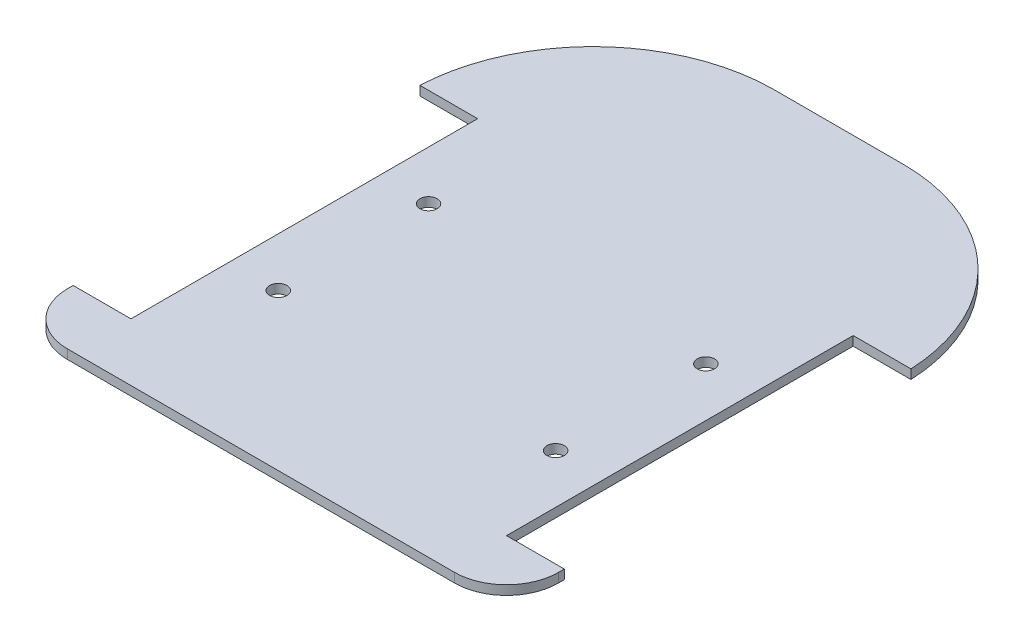
ISO-10303-21;
HEADER;
FILE_DESCRIPTION(('STEP AP214'),'2;1');
FILE_NAME('part.step','',(''),(''),'','','');
FILE_SCHEMA(('AUTOMOTIVE_DESIGN { 1 0 10303 214 1 1 1 1 }'));
ENDSEC;
DATA;
#1=APPLICATION_CONTEXT('core data for automotive mechanical design processes');
#2=APPLICATION_PROTOCOL_DEFINITION('international standard','automotive_design',2000,#1);
#3=PRODUCT_CONTEXT('',#1,'mechanical');
#4=PRODUCT('Part','Part','',(#3));
#5=PRODUCT_RELATED_PRODUCT_CATEGORY('part','',(#4));
#6=PRODUCT_DEFINITION_FORMATION('','',#4);
#7=PRODUCT_DEFINITION_CONTEXT('part definition',#1,'design');
#8=PRODUCT_DEFINITION('design','',#6,#7);
#9=PRODUCT_DEFINITION_SHAPE('','',#8);
#10=(LENGTH_UNIT() NAMED_UNIT(*) SI_UNIT(.MILLI.,.METRE.));
#11=(NAMED_UNIT(*) PLANE_ANGLE_UNIT() SI_UNIT($,.RADIAN.));
#12=(NAMED_UNIT(*) SI_UNIT($,.STERADIAN.) SOLID_ANGLE_UNIT());
#13=UNCERTAINTY_MEASURE_WITH_UNIT(LENGTH_MEASURE(1.E-05),#10,'distance_accuracy_value','');
#14=(GEOMETRIC_REPRESENTATION_CONTEXT(3) GLOBAL_UNCERTAINTY_ASSIGNED_CONTEXT((#13)) GLOBAL_UNIT_ASSIGNED_CONTEXT((#10,
#11,#12)) REPRESENTATION_CONTEXT('',''));
#15=CARTESIAN_POINT('',(0.,0.,0.));
#16=DIRECTION('',(0.,0.,1.));
#17=DIRECTION('',(1.,0.,0.));
#18=AXIS2_PLACEMENT_3D('',#15,#16,#17);
#19=CARTESIAN_POINT('',(26.5,0.,23.));
#20=DIRECTION('',(0.,1.,0.));
#21=DIRECTION('',(0.,0.,1.));
#22=AXIS2_PLACEMENT_3D('',#19,#20,#21);
#23=CYLINDRICAL_SURFACE('',#22,1.5);
#24=CARTESIAN_POINT('',(26.5,0.,23.));
#25=DIRECTION('',(0.,1.,0.));
#26=DIRECTION('',(0.,0.,-1.));
#27=AXIS2_PLACEMENT_3D('',#24,#25,#26);
#28=CIRCLE('',#27,1.5);
#29=CARTESIAN_POINT('',(26.5,0.,21.5));
#30=VERTEX_POINT('',#29);
#31=EDGE_CURVE('E136',#30,#30,#28,.T.);
#32=ORIENTED_EDGE('',*,*,#31,.F.);
#33=EDGE_LOOP('',(#32));
#34=FACE_BOUND('',#33,.T.);
#35=CARTESIAN_POINT('',(26.5,1.6,23.));
#36=DIRECTION('',(0.,1.,0.));
#37=DIRECTION('',(0.,0.,-1.));
#38=AXIS2_PLACEMENT_3D('',#35,#36,#37);
#39=CIRCLE('',#38,1.5);
#40=CARTESIAN_POINT('',(26.5,1.6,21.5));
#41=VERTEX_POINT('',#40);
#42=EDGE_CURVE('E183',#41,#41,#39,.T.);
#43=ORIENTED_EDGE('',*,*,#42,.T.);
#44=EDGE_LOOP('',(#43));
#45=FACE_BOUND('',#44,.T.);
#46=ADVANCED_FACE('F34',(#34,#45),#23,.F.);
#47=CARTESIAN_POINT('',(26.5,0.,-2.99999999999999));
#48=DIRECTION('',(0.,1.,0.));
#49=DIRECTION('',(0.,0.,1.));
#50=AXIS2_PLACEMENT_3D('',#47,#48,#49);
#51=CYLINDRICAL_SURFACE('',#50,1.5);
#52=CARTESIAN_POINT('',(26.5,0.,-2.99999999999999));
#53=DIRECTION('',(0.,1.,0.));
#54=DIRECTION('',(0.,0.,-1.));
#55=AXIS2_PLACEMENT_3D('',#52,#53,#54);
#56=CIRCLE('',#55,1.5);
#57=CARTESIAN_POINT('',(26.5,0.,-4.49999999999999));
#58=VERTEX_POINT('',#57);
#59=EDGE_CURVE('E179',#58,#58,#56,.T.);
#60=ORIENTED_EDGE('',*,*,#59,.F.);
#61=EDGE_LOOP('',(#60));
#62=FACE_BOUND('',#61,.T.);
#63=CARTESIAN_POINT('',(26.5,1.6,-2.99999999999999));
#64=DIRECTION('',(0.,1.,0.));
#65=DIRECTION('',(0.,0.,-1.));
#66=AXIS2_PLACEMENT_3D('',#63,#64,#65);
#67=CIRCLE('',#66,1.5);
#68=CARTESIAN_POINT('',(26.5,1.6,-4.49999999999999));
#69=VERTEX_POINT('',#68);
#70=EDGE_CURVE('E176',#69,#69,#67,.T.);
#71=ORIENTED_EDGE('',*,*,#70,.T.);
#72=EDGE_LOOP('',(#71));
#73=FACE_BOUND('',#72,.T.);
#74=ADVANCED_FACE('F314',(#62,#73),#51,.F.);
#75=CARTESIAN_POINT('',(36.,1.6,41.));
#76=DIRECTION('',(0.,-1.,0.));
#77=DIRECTION('',(0.,0.,-1.));
#78=AXIS2_PLACEMENT_3D('',#75,#76,#77);
#79=CYLINDRICAL_SURFACE('',#78,8.99999999999999);
#80=CARTESIAN_POINT('',(36.,0.,41.));
#81=DIRECTION('',(0.,1.,0.));
#82=DIRECTION('',(0.,0.,1.));
#83=AXIS2_PLACEMENT_3D('',#80,#81,#82);
#84=CIRCLE('',#83,8.99999999999999);
#85=CARTESIAN_POINT('',(36.,0.,50.));
#86=VERTEX_POINT('',#85);
#87=CARTESIAN_POINT('',(45.,0.,41.));
#88=VERTEX_POINT('',#87);
#89=EDGE_CURVE('E135',#86,#88,#84,.T.);
#90=ORIENTED_EDGE('',*,*,#89,.T.);
#91=DIRECTION('',(0.,-1.,0.));
#92=VECTOR('',#91,1.);
#93=CARTESIAN_POINT('',(45.,1.6,41.));
#94=LINE('',#93,#92);
#95=CARTESIAN_POINT('',(45.,1.6,41.));
#96=VERTEX_POINT('',#95);
#97=EDGE_CURVE('E43',#96,#88,#94,.T.);
#98=ORIENTED_EDGE('',*,*,#97,.F.);
#99=CARTESIAN_POINT('',(36.,1.6,41.));
#100=DIRECTION('',(0.,1.,0.));
#101=DIRECTION('',(0.,0.,1.));
#102=AXIS2_PLACEMENT_3D('',#99,#100,#101);
#103=CIRCLE('',#102,8.99999999999999);
#104=CARTESIAN_POINT('',(36.,1.6,50.));
#105=VERTEX_POINT('',#104);
#106=EDGE_CURVE('E171',#105,#96,#103,.T.);
#107=ORIENTED_EDGE('',*,*,#106,.F.);
#108=DIRECTION('',(0.,-1.,0.));
#109=VECTOR('',#108,1.);
#110=CARTESIAN_POINT('',(36.,1.6,50.));
#111=LINE('',#110,#109);
#112=EDGE_CURVE('E11',#105,#86,#111,.T.);
#113=ORIENTED_EDGE('',*,*,#112,.T.);
#114=EDGE_LOOP('',(#90,#98,#107,#113));
#115=FACE_BOUND('',#114,.T.);
#116=ADVANCED_FACE('F312',(#115),#79,.T.);
#117=CARTESIAN_POINT('',(45.,1.6,40.));
#118=DIRECTION('',(-1.,0.,0.));
#119=DIRECTION('',(0.,0.,1.));
#120=AXIS2_PLACEMENT_3D('',#117,#118,#119);
#121=PLANE('',#120);
#122=DIRECTION('',(0.,0.,-1.));
#123=VECTOR('',#122,1.);
#124=CARTESIAN_POINT('',(45.,0.,40.));
#125=LINE('',#124,#123);
#126=CARTESIAN_POINT('',(45.,0.,40.));
#127=VERTEX_POINT('',#126);
#128=EDGE_CURVE('E138',#88,#127,#125,.T.);
#129=ORIENTED_EDGE('',*,*,#128,.T.);
#130=DIRECTION('',(0.,-1.,0.));
#131=VECTOR('',#130,1.);
#132=CARTESIAN_POINT('',(45.,1.6,40.));
#133=LINE('',#132,#131);
#134=CARTESIAN_POINT('',(45.,1.6,40.));
#135=VERTEX_POINT('',#134);
#136=EDGE_CURVE('E151',#135,#127,#133,.T.);
#137=ORIENTED_EDGE('',*,*,#136,.F.);
#138=DIRECTION('',(0.,0.,-1.));
#139=VECTOR('',#138,1.);
#140=CARTESIAN_POINT('',(45.,1.6,40.));
#141=LINE('',#140,#139);
#142=EDGE_CURVE('E160',#96,#135,#141,.T.);
#143=ORIENTED_EDGE('',*,*,#142,.F.);
#144=ORIENTED_EDGE('',*,*,#97,.T.);
#145=EDGE_LOOP('',(#129,#137,#143,#144));
#146=FACE_BOUND('',#145,.T.);
#147=ADVANCED_FACE('F158',(#146),#121,.F.);
#148=CARTESIAN_POINT('',(35.,1.6,40.));
#149=DIRECTION('',(0.,0.,1.));
#150=DIRECTION('',(1.,0.,0.));
#151=AXIS2_PLACEMENT_3D('',#148,#149,#150);
#152=PLANE('',#151);
#153=DIRECTION('',(-1.,0.,0.));
#154=VECTOR('',#153,1.);
#155=CARTESIAN_POINT('',(35.,0.,40.));
#156=LINE('',#155,#154);
#157=CARTESIAN_POINT('',(35.,0.,40.));
#158=VERTEX_POINT('',#157);
#159=EDGE_CURVE('E140',#127,#158,#156,.T.);
#160=ORIENTED_EDGE('',*,*,#159,.T.);
#161=DIRECTION('',(0.,-1.,0.));
#162=VECTOR('',#161,1.);
#163=CARTESIAN_POINT('',(35.,1.6,40.));
#164=LINE('',#163,#162);
#165=CARTESIAN_POINT('',(35.,1.6,40.));
#166=VERTEX_POINT('',#165);
#167=EDGE_CURVE('E122',#166,#158,#164,.T.);
#168=ORIENTED_EDGE('',*,*,#167,.F.);
#169=DIRECTION('',(-1.,0.,0.));
#170=VECTOR('',#169,1.);
#171=CARTESIAN_POINT('',(35.,1.6,40.));
#172=LINE('',#171,#170);
#173=EDGE_CURVE('E113',#135,#166,#172,.T.);
#174=ORIENTED_EDGE('',*,*,#173,.F.);
#175=ORIENTED_EDGE('',*,*,#136,.T.);
#176=EDGE_LOOP('',(#160,#168,#174,#175));
#177=FACE_BOUND('',#176,.T.);
#178=ADVANCED_FACE('F170',(#177),#152,.F.);
#179=CARTESIAN_POINT('',(35.,1.6,-20.));
#180=DIRECTION('',(-1.,0.,0.));
#181=DIRECTION('',(0.,0.,1.));
#182=AXIS2_PLACEMENT_3D('',#179,#180,#181);
#183=PLANE('',#182);
#184=DIRECTION('',(0.,0.,-1.));
#185=VECTOR('',#184,1.);
#186=CARTESIAN_POINT('',(35.,0.,-20.));
#187=LINE('',#186,#185);
#188=CARTESIAN_POINT('',(35.,0.,-20.));
#189=VERTEX_POINT('',#188);
#190=EDGE_CURVE('E121',#158,#189,#187,.T.);
#191=ORIENTED_EDGE('',*,*,#190,.T.);
#192=DIRECTION('',(0.,-1.,0.));
#193=VECTOR('',#192,1.);
#194=CARTESIAN_POINT('',(35.,1.6,-20.));
#195=LINE('',#194,#193);
#196=CARTESIAN_POINT('',(35.,1.6,-20.));
#197=VERTEX_POINT('',#196);
#198=EDGE_CURVE('E118',#197,#189,#195,.T.);
#199=ORIENTED_EDGE('',*,*,#198,.F.);
#200=DIRECTION('',(0.,0.,-1.));
#201=VECTOR('',#200,1.);
#202=CARTESIAN_POINT('',(35.,1.6,-20.));
#203=LINE('',#202,#201);
#204=EDGE_CURVE('E106',#166,#197,#203,.T.);
#205=ORIENTED_EDGE('',*,*,#204,.F.);
#206=ORIENTED_EDGE('',*,*,#167,.T.);
#207=EDGE_LOOP('',(#191,#199,#205,#206));
#208=FACE_BOUND('',#207,.T.);
#209=ADVANCED_FACE('F119',(#208),#183,.F.);
#210=CARTESIAN_POINT('',(45.,1.6,-20.));
#211=DIRECTION('',(0.,0.,-1.));
#212=DIRECTION('',(-1.,0.,0.));
#213=AXIS2_PLACEMENT_3D('',#210,#211,#212);
#214=PLANE('',#213);
#215=DIRECTION('',(1.,0.,0.));
#216=VECTOR('',#215,1.);
#217=CARTESIAN_POINT('',(45.,0.,-20.));
#218=LINE('',#217,#216);
#219=CARTESIAN_POINT('',(45.,0.,-20.));
#220=VERTEX_POINT('',#219);
#221=EDGE_CURVE('E78',#189,#220,#218,.T.);
#222=ORIENTED_EDGE('',*,*,#221,.T.);
#223=DIRECTION('',(0.,-1.,0.));
#224=VECTOR('',#223,1.);
#225=CARTESIAN_POINT('',(45.,1.6,-20.));
#226=LINE('',#225,#224);
#227=CARTESIAN_POINT('',(45.,1.6,-20.));
#228=VERTEX_POINT('',#227);
#229=EDGE_CURVE('E123',#228,#220,#226,.T.);
#230=ORIENTED_EDGE('',*,*,#229,.F.);
#231=DIRECTION('',(1.,0.,0.));
#232=VECTOR('',#231,1.);
#233=CARTESIAN_POINT('',(45.,1.6,-20.));
#234=LINE('',#233,#232);
#235=EDGE_CURVE('E111',#197,#228,#234,.T.);
#236=ORIENTED_EDGE('',*,*,#235,.F.);
#237=ORIENTED_EDGE('',*,*,#198,.T.);
#238=EDGE_LOOP('',(#222,#230,#236,#237));
#239=FACE_BOUND('',#238,.T.);
#240=ADVANCED_FACE('F125',(#239),#214,.F.);
#241=CARTESIAN_POINT('',(13.5841722811039,1.6,-18.5528585213575));
#242=DIRECTION('',(0.,-1.,0.));
#243=DIRECTION('',(0.,0.,-1.));
#244=AXIS2_PLACEMENT_3D('',#241,#242,#243);
#245=CYLINDRICAL_SURFACE('',#244,31.4491406833727);
#246=CARTESIAN_POINT('',(13.5841722811039,0.,-18.5528585213575));
#247=DIRECTION('',(0.,1.,0.));
#248=DIRECTION('',(0.,0.,1.));
#249=AXIS2_PLACEMENT_3D('',#246,#247,#248);
#250=CIRCLE('',#249,31.4491406833727);
#251=CARTESIAN_POINT('',(13.9387742337388,0.,-50.));
#252=VERTEX_POINT('',#251);
#253=EDGE_CURVE('E84',#220,#252,#250,.T.);
#254=ORIENTED_EDGE('',*,*,#253,.T.);
#255=DIRECTION('',(0.,-1.,0.));
#256=VECTOR('',#255,1.);
#257=CARTESIAN_POINT('',(13.9387742337388,1.6,-50.));
#258=LINE('',#257,#256);
#259=CARTESIAN_POINT('',(13.9387742337388,1.6,-50.));
#260=VERTEX_POINT('',#259);
#261=EDGE_CURVE('E132',#260,#252,#258,.T.);
#262=ORIENTED_EDGE('',*,*,#261,.F.);
#263=CARTESIAN_POINT('',(13.5841722811039,1.6,-18.5528585213575));
#264=DIRECTION('',(0.,1.,0.));
#265=DIRECTION('',(0.,0.,1.));
#266=AXIS2_PLACEMENT_3D('',#263,#264,#265);
#267=CIRCLE('',#266,31.4491406833727);
#268=EDGE_CURVE('E51',#228,#260,#267,.T.);
#269=ORIENTED_EDGE('',*,*,#268,.F.);
#270=ORIENTED_EDGE('',*,*,#229,.T.);
#271=EDGE_LOOP('',(#254,#262,#269,#270));
#272=FACE_BOUND('',#271,.T.);
#273=ADVANCED_FACE('F339',(#272),#245,.T.);
#274=CARTESIAN_POINT('',(-13.5841722811039,1.6,-18.5528585213575));
#275=DIRECTION('',(0.,-1.,0.));
#276=DIRECTION('',(0.,0.,-1.));
#277=AXIS2_PLACEMENT_3D('',#274,#275,#276);
#278=PLANE('',#277);
#279=ORIENTED_EDGE('',*,*,#70,.F.);
#280=EDGE_LOOP('',(#279));
#281=FACE_BOUND('',#280,.T.);
#282=ORIENTED_EDGE('',*,*,#42,.F.);
#283=EDGE_LOOP('',(#282));
#284=FACE_BOUND('',#283,.T.);
#285=DIRECTION('',(-1.,0.,0.));
#286=VECTOR('',#285,1.);
#287=CARTESIAN_POINT('',(-13.9387742337388,1.6,-50.));
#288=LINE('',#287,#286);
#289=CARTESIAN_POINT('',(-8.93877423373881,1.6,-50.));
#290=VERTEX_POINT('',#289);
#291=EDGE_CURVE('E127',#260,#290,#288,.T.);
#292=ORIENTED_EDGE('',*,*,#291,.T.);
#293=CARTESIAN_POINT('',(-8.58417228110387,1.6,-18.5528585213575));
#294=DIRECTION('',(0.,1.,0.));
#295=DIRECTION('',(0.,0.,-1.));
#296=AXIS2_PLACEMENT_3D('',#293,#294,#295);
#297=CIRCLE('',#296,31.4491406833727);
#298=CARTESIAN_POINT('',(-40.,1.6,-20.));
#299=VERTEX_POINT('',#298);
#300=EDGE_CURVE('E202',#290,#299,#297,.T.);
#301=ORIENTED_EDGE('',*,*,#300,.T.);
#302=DIRECTION('',(1.,0.,0.));
#303=VECTOR('',#302,1.);
#304=CARTESIAN_POINT('',(-40.,1.6,-20.));
#305=LINE('',#304,#303);
#306=CARTESIAN_POINT('',(-30.,1.6,-20.));
#307=VERTEX_POINT('',#306);
#308=EDGE_CURVE('E205',#299,#307,#305,.T.);
#309=ORIENTED_EDGE('',*,*,#308,.T.);
#310=DIRECTION('',(0.,0.,1.));
#311=VECTOR('',#310,1.);
#312=CARTESIAN_POINT('',(-30.,1.6,-20.));
#313=LINE('',#312,#311);
#314=CARTESIAN_POINT('',(-30.,1.6,40.));
#315=VERTEX_POINT('',#314);
#316=EDGE_CURVE('E209',#307,#315,#313,.T.);
#317=ORIENTED_EDGE('',*,*,#316,.T.);
#318=DIRECTION('',(-1.,0.,0.));
#319=VECTOR('',#318,1.);
#320=CARTESIAN_POINT('',(-30.,1.6,40.));
#321=LINE('',#320,#319);
#322=CARTESIAN_POINT('',(-40.,1.6,40.));
#323=VERTEX_POINT('',#322);
#324=EDGE_CURVE('E212',#315,#323,#321,.T.);
#325=ORIENTED_EDGE('',*,*,#324,.T.);
#326=DIRECTION('',(0.,0.,1.));
#327=VECTOR('',#326,1.);
#328=CARTESIAN_POINT('',(-40.,1.6,40.));
#329=LINE('',#328,#327);
#330=CARTESIAN_POINT('',(-40.,1.6,41.));
#331=VERTEX_POINT('',#330);
#332=EDGE_CURVE('E215',#323,#331,#329,.T.);
#333=ORIENTED_EDGE('',*,*,#332,.T.);
#334=CARTESIAN_POINT('',(-31.,1.6,41.));
#335=DIRECTION('',(0.,1.,0.));
#336=DIRECTION('',(0.,0.,1.));
#337=AXIS2_PLACEMENT_3D('',#334,#335,#336);
#338=CIRCLE('',#337,9.);
#339=CARTESIAN_POINT('',(-31.,1.6,50.));
#340=VERTEX_POINT('',#339);
#341=EDGE_CURVE('E198',#331,#340,#338,.T.);
#342=ORIENTED_EDGE('',*,*,#341,.T.);
#343=DIRECTION('',(1.,0.,0.));
#344=VECTOR('',#343,1.);
#345=CARTESIAN_POINT('',(-35.9999999999999,1.6,50.));
#346=LINE('',#345,#344);
#347=EDGE_CURVE('E92',#340,#105,#346,.T.);
#348=ORIENTED_EDGE('',*,*,#347,.T.);
#349=ORIENTED_EDGE('',*,*,#106,.T.);
#350=ORIENTED_EDGE('',*,*,#142,.T.);
#351=ORIENTED_EDGE('',*,*,#173,.T.);
#352=ORIENTED_EDGE('',*,*,#204,.T.);
#353=ORIENTED_EDGE('',*,*,#235,.T.);
#354=ORIENTED_EDGE('',*,*,#268,.T.);
#355=EDGE_LOOP('',(#292,#301,#309,#317,#325,#333,#342,#348,#349,#350,#351,#352,#353,#354));
#356=FACE_BOUND('',#355,.T.);
#357=CARTESIAN_POINT('',(-21.5,1.6,23.));
#358=DIRECTION('',(0.,1.,0.));
#359=DIRECTION('',(0.,0.,1.));
#360=AXIS2_PLACEMENT_3D('',#357,#358,#359);
#361=CIRCLE('',#360,1.5);
#362=CARTESIAN_POINT('',(-21.5,1.6,24.5));
#363=VERTEX_POINT('',#362);
#364=EDGE_CURVE('E180',#363,#363,#361,.T.);
#365=ORIENTED_EDGE('',*,*,#364,.F.);
#366=EDGE_LOOP('',(#365));
#367=FACE_BOUND('',#366,.T.);
#368=CARTESIAN_POINT('',(-21.5,1.6,-2.99999999999999));
#369=DIRECTION('',(0.,1.,0.));
#370=DIRECTION('',(0.,0.,1.));
#371=AXIS2_PLACEMENT_3D('',#368,#369,#370);
#372=CIRCLE('',#371,1.5);
#373=CARTESIAN_POINT('',(-21.5,1.6,-1.49999999999999));
#374=VERTEX_POINT('',#373);
#375=EDGE_CURVE('E195',#374,#374,#372,.T.);
#376=ORIENTED_EDGE('',*,*,#375,.F.);
#377=EDGE_LOOP('',(#376));
#378=FACE_BOUND('',#377,.T.);
#379=ADVANCED_FACE('F108',(#281,#284,#356,#367,#378),#278,.F.);
#380=CARTESIAN_POINT('',(-13.5841722811039,0.,-18.5528585213575));
#381=DIRECTION('',(0.,-1.,0.));
#382=DIRECTION('',(0.,0.,-1.));
#383=AXIS2_PLACEMENT_3D('',#380,#381,#382);
#384=PLANE('',#383);
#385=DIRECTION('',(1.,0.,0.));
#386=VECTOR('',#385,1.);
#387=CARTESIAN_POINT('',(-35.9999999999999,0.,50.));
#388=LINE('',#387,#386);
#389=CARTESIAN_POINT('',(-31.,0.,50.));
#390=VERTEX_POINT('',#389);
#391=EDGE_CURVE('E133',#390,#86,#388,.T.);
#392=ORIENTED_EDGE('',*,*,#391,.F.);
#393=CARTESIAN_POINT('',(-31.,0.,41.));
#394=DIRECTION('',(0.,1.,0.));
#395=DIRECTION('',(0.,0.,1.));
#396=AXIS2_PLACEMENT_3D('',#393,#394,#395);
#397=CIRCLE('',#396,9.);
#398=CARTESIAN_POINT('',(-40.,0.,41.));
#399=VERTEX_POINT('',#398);
#400=EDGE_CURVE('E238',#399,#390,#397,.T.);
#401=ORIENTED_EDGE('',*,*,#400,.F.);
#402=DIRECTION('',(0.,0.,1.));
#403=VECTOR('',#402,1.);
#404=CARTESIAN_POINT('',(-40.,0.,40.));
#405=LINE('',#404,#403);
#406=CARTESIAN_POINT('',(-40.,0.,40.));
#407=VERTEX_POINT('',#406);
#408=EDGE_CURVE('E234',#407,#399,#405,.T.);
#409=ORIENTED_EDGE('',*,*,#408,.F.);
#410=DIRECTION('',(-1.,0.,0.));
#411=VECTOR('',#410,1.);
#412=CARTESIAN_POINT('',(-30.,0.,40.));
#413=LINE('',#412,#411);
#414=CARTESIAN_POINT('',(-30.,0.,40.));
#415=VERTEX_POINT('',#414);
#416=EDGE_CURVE('E230',#415,#407,#413,.T.);
#417=ORIENTED_EDGE('',*,*,#416,.F.);
#418=DIRECTION('',(0.,0.,1.));
#419=VECTOR('',#418,1.);
#420=CARTESIAN_POINT('',(-30.,0.,-20.));
#421=LINE('',#420,#419);
#422=CARTESIAN_POINT('',(-30.,0.,-20.));
#423=VERTEX_POINT('',#422);
#424=EDGE_CURVE('E226',#423,#415,#421,.T.);
#425=ORIENTED_EDGE('',*,*,#424,.F.);
#426=DIRECTION('',(1.,0.,0.));
#427=VECTOR('',#426,1.);
#428=CARTESIAN_POINT('',(-40.,0.,-20.));
#429=LINE('',#428,#427);
#430=CARTESIAN_POINT('',(-40.,0.,-20.));
#431=VERTEX_POINT('',#430);
#432=EDGE_CURVE('E222',#431,#423,#429,.T.);
#433=ORIENTED_EDGE('',*,*,#432,.F.);
#434=CARTESIAN_POINT('',(-8.58417228110387,0.,-18.5528585213575));
#435=DIRECTION('',(0.,1.,0.));
#436=DIRECTION('',(0.,0.,-1.));
#437=AXIS2_PLACEMENT_3D('',#434,#435,#436);
#438=CIRCLE('',#437,31.4491406833727);
#439=CARTESIAN_POINT('',(-8.93877423373881,0.,-50.));
#440=VERTEX_POINT('',#439);
#441=EDGE_CURVE('E191',#440,#431,#438,.T.);
#442=ORIENTED_EDGE('',*,*,#441,.F.);
#443=DIRECTION('',(-1.,0.,0.));
#444=VECTOR('',#443,1.);
#445=CARTESIAN_POINT('',(-13.9387742337388,0.,-50.));
#446=LINE('',#445,#444);
#447=EDGE_CURVE('E145',#252,#440,#446,.T.);
#448=ORIENTED_EDGE('',*,*,#447,.F.);
#449=ORIENTED_EDGE('',*,*,#253,.F.);
#450=ORIENTED_EDGE('',*,*,#221,.F.);
#451=ORIENTED_EDGE('',*,*,#190,.F.);
#452=ORIENTED_EDGE('',*,*,#159,.F.);
#453=ORIENTED_EDGE('',*,*,#128,.F.);
#454=ORIENTED_EDGE('',*,*,#89,.F.);
#455=EDGE_LOOP('',(#392,#401,#409,#417,#425,#433,#442,#448,#449,#450,#451,#452,#453,#454));
#456=FACE_BOUND('',#455,.T.);
#457=ORIENTED_EDGE('',*,*,#59,.T.);
#458=EDGE_LOOP('',(#457));
#459=FACE_BOUND('',#458,.T.);
#460=ORIENTED_EDGE('',*,*,#31,.T.);
#461=EDGE_LOOP('',(#460));
#462=FACE_BOUND('',#461,.T.);
#463=CARTESIAN_POINT('',(-21.5,0.,-2.99999999999999));
#464=DIRECTION('',(0.,1.,0.));
#465=DIRECTION('',(0.,0.,1.));
#466=AXIS2_PLACEMENT_3D('',#463,#464,#465);
#467=CIRCLE('',#466,1.5);
#468=CARTESIAN_POINT('',(-21.5,0.,-1.49999999999999));
#469=VERTEX_POINT('',#468);
#470=EDGE_CURVE('E192',#469,#469,#467,.T.);
#471=ORIENTED_EDGE('',*,*,#470,.T.);
#472=EDGE_LOOP('',(#471));
#473=FACE_BOUND('',#472,.T.);
#474=CARTESIAN_POINT('',(-21.5,0.,23.));
#475=DIRECTION('',(0.,1.,0.));
#476=DIRECTION('',(0.,0.,1.));
#477=AXIS2_PLACEMENT_3D('',#474,#475,#476);
#478=CIRCLE('',#477,1.5);
#479=CARTESIAN_POINT('',(-21.5,0.,24.5));
#480=VERTEX_POINT('',#479);
#481=EDGE_CURVE('E188',#480,#480,#478,.T.);
#482=ORIENTED_EDGE('',*,*,#481,.T.);
#483=EDGE_LOOP('',(#482));
#484=FACE_BOUND('',#483,.T.);
#485=ADVANCED_FACE('F167',(#456,#459,#462,#473,#484),#384,.T.);
#486=CARTESIAN_POINT('',(-13.9387742337388,1.6,-50.));
#487=DIRECTION('',(0.,0.,1.));
#488=DIRECTION('',(1.,0.,0.));
#489=AXIS2_PLACEMENT_3D('',#486,#487,#488);
#490=PLANE('',#489);
#491=ORIENTED_EDGE('',*,*,#447,.T.);
#492=DIRECTION('',(0.,-1.,0.));
#493=VECTOR('',#492,1.);
#494=CARTESIAN_POINT('',(-8.93877423373881,1.6,-50.));
#495=LINE('',#494,#493);
#496=EDGE_CURVE('E221',#290,#440,#495,.T.);
#497=ORIENTED_EDGE('',*,*,#496,.F.);
#498=ORIENTED_EDGE('',*,*,#291,.F.);
#499=ORIENTED_EDGE('',*,*,#261,.T.);
#500=EDGE_LOOP('',(#491,#497,#498,#499));
#501=FACE_BOUND('',#500,.T.);
#502=ADVANCED_FACE('F343',(#501),#490,.F.);
#503=CARTESIAN_POINT('',(-35.9999999999999,1.6,50.));
#504=DIRECTION('',(0.,0.,-1.));
#505=DIRECTION('',(-1.,0.,0.));
#506=AXIS2_PLACEMENT_3D('',#503,#504,#505);
#507=PLANE('',#506);
#508=ORIENTED_EDGE('',*,*,#347,.F.);
#509=DIRECTION('',(0.,-1.,0.));
#510=VECTOR('',#509,1.);
#511=CARTESIAN_POINT('',(-31.,1.6,50.));
#512=LINE('',#511,#510);
#513=EDGE_CURVE('E206',#340,#390,#512,.T.);
#514=ORIENTED_EDGE('',*,*,#513,.T.);
#515=ORIENTED_EDGE('',*,*,#391,.T.);
#516=ORIENTED_EDGE('',*,*,#112,.F.);
#517=EDGE_LOOP('',(#508,#514,#515,#516));
#518=FACE_BOUND('',#517,.T.);
#519=ADVANCED_FACE('F36',(#518),#507,.F.);
#520=CARTESIAN_POINT('',(-8.58417228110387,1.6,-18.5528585213575));
#521=DIRECTION('',(0.,-1.,0.));
#522=DIRECTION('',(0.,0.,-1.));
#523=AXIS2_PLACEMENT_3D('',#520,#521,#522);
#524=CYLINDRICAL_SURFACE('',#523,31.4491406833727);
#525=ORIENTED_EDGE('',*,*,#441,.T.);
#526=DIRECTION('',(0.,-1.,0.));
#527=VECTOR('',#526,1.);
#528=CARTESIAN_POINT('',(-40.,1.6,-20.));
#529=LINE('',#528,#527);
#530=EDGE_CURVE('E225',#299,#431,#529,.T.);
#531=ORIENTED_EDGE('',*,*,#530,.F.);
#532=ORIENTED_EDGE('',*,*,#300,.F.);
#533=ORIENTED_EDGE('',*,*,#496,.T.);
#534=EDGE_LOOP('',(#525,#531,#532,#533));
#535=FACE_BOUND('',#534,.T.);
#536=ADVANCED_FACE('F267',(#535),#524,.T.);
#537=CARTESIAN_POINT('',(-40.,1.6,-20.));
#538=DIRECTION('',(0.,0.,-1.));
#539=DIRECTION('',(-1.,0.,0.));
#540=AXIS2_PLACEMENT_3D('',#537,#538,#539);
#541=PLANE('',#540);
#542=ORIENTED_EDGE('',*,*,#432,.T.);
#543=DIRECTION('',(0.,-1.,0.));
#544=VECTOR('',#543,1.);
#545=CARTESIAN_POINT('',(-30.,1.6,-20.));
#546=LINE('',#545,#544);
#547=EDGE_CURVE('E229',#307,#423,#546,.T.);
#548=ORIENTED_EDGE('',*,*,#547,.F.);
#549=ORIENTED_EDGE('',*,*,#308,.F.);
#550=ORIENTED_EDGE('',*,*,#530,.T.);
#551=EDGE_LOOP('',(#542,#548,#549,#550));
#552=FACE_BOUND('',#551,.T.);
#553=ADVANCED_FACE('F258',(#552),#541,.F.);
#554=CARTESIAN_POINT('',(-30.,1.6,-20.));
#555=DIRECTION('',(1.,0.,0.));
#556=DIRECTION('',(0.,0.,-1.));
#557=AXIS2_PLACEMENT_3D('',#554,#555,#556);
#558=PLANE('',#557);
#559=ORIENTED_EDGE('',*,*,#424,.T.);
#560=DIRECTION('',(0.,-1.,0.));
#561=VECTOR('',#560,1.);
#562=CARTESIAN_POINT('',(-30.,1.6,40.));
#563=LINE('',#562,#561);
#564=EDGE_CURVE('E233',#315,#415,#563,.T.);
#565=ORIENTED_EDGE('',*,*,#564,.F.);
#566=ORIENTED_EDGE('',*,*,#316,.F.);
#567=ORIENTED_EDGE('',*,*,#547,.T.);
#568=EDGE_LOOP('',(#559,#565,#566,#567));
#569=FACE_BOUND('',#568,.T.);
#570=ADVANCED_FACE('F295',(#569),#558,.F.);
#571=CARTESIAN_POINT('',(-30.,1.6,40.));
#572=DIRECTION('',(0.,0.,1.));
#573=DIRECTION('',(1.,0.,0.));
#574=AXIS2_PLACEMENT_3D('',#571,#572,#573);
#575=PLANE('',#574);
#576=ORIENTED_EDGE('',*,*,#416,.T.);
#577=DIRECTION('',(0.,-1.,0.));
#578=VECTOR('',#577,1.);
#579=CARTESIAN_POINT('',(-40.,1.6,40.));
#580=LINE('',#579,#578);
#581=EDGE_CURVE('E237',#323,#407,#580,.T.);
#582=ORIENTED_EDGE('',*,*,#581,.F.);
#583=ORIENTED_EDGE('',*,*,#324,.F.);
#584=ORIENTED_EDGE('',*,*,#564,.T.);
#585=EDGE_LOOP('',(#576,#582,#583,#584));
#586=FACE_BOUND('',#585,.T.);
#587=ADVANCED_FACE('F300',(#586),#575,.F.);
#588=CARTESIAN_POINT('',(-40.,1.6,40.));
#589=DIRECTION('',(1.,0.,0.));
#590=DIRECTION('',(0.,0.,-1.));
#591=AXIS2_PLACEMENT_3D('',#588,#589,#590);
#592=PLANE('',#591);
#593=ORIENTED_EDGE('',*,*,#408,.T.);
#594=DIRECTION('',(0.,-1.,0.));
#595=VECTOR('',#594,1.);
#596=CARTESIAN_POINT('',(-40.,1.6,41.));
#597=LINE('',#596,#595);
#598=EDGE_CURVE('E201',#331,#399,#597,.T.);
#599=ORIENTED_EDGE('',*,*,#598,.F.);
#600=ORIENTED_EDGE('',*,*,#332,.F.);
#601=ORIENTED_EDGE('',*,*,#581,.T.);
#602=EDGE_LOOP('',(#593,#599,#600,#601));
#603=FACE_BOUND('',#602,.T.);
#604=ADVANCED_FACE('F306',(#603),#592,.F.);
#605=CARTESIAN_POINT('',(-31.,1.6,41.));
#606=DIRECTION('',(0.,-1.,0.));
#607=DIRECTION('',(0.,0.,-1.));
#608=AXIS2_PLACEMENT_3D('',#605,#606,#607);
#609=CYLINDRICAL_SURFACE('',#608,9.);
#610=ORIENTED_EDGE('',*,*,#400,.T.);
#611=ORIENTED_EDGE('',*,*,#513,.F.);
#612=ORIENTED_EDGE('',*,*,#341,.F.);
#613=ORIENTED_EDGE('',*,*,#598,.T.);
#614=EDGE_LOOP('',(#610,#611,#612,#613));
#615=FACE_BOUND('',#614,.T.);
#616=ADVANCED_FACE('F310',(#615),#609,.T.);
#617=CARTESIAN_POINT('',(-21.5,0.,-2.99999999999999));
#618=DIRECTION('',(0.,1.,0.));
#619=DIRECTION('',(0.,0.,1.));
#620=AXIS2_PLACEMENT_3D('',#617,#618,#619);
#621=CYLINDRICAL_SURFACE('',#620,1.5);
#622=ORIENTED_EDGE('',*,*,#470,.F.);
#623=EDGE_LOOP('',(#622));
#624=FACE_BOUND('',#623,.T.);
#625=ORIENTED_EDGE('',*,*,#375,.T.);
#626=EDGE_LOOP('',(#625));
#627=FACE_BOUND('',#626,.T.);
#628=ADVANCED_FACE('F438',(#624,#627),#621,.F.);
#629=CARTESIAN_POINT('',(-21.5,0.,23.));
#630=DIRECTION('',(0.,1.,0.));
#631=DIRECTION('',(0.,0.,1.));
#632=AXIS2_PLACEMENT_3D('',#629,#630,#631);
#633=CYLINDRICAL_SURFACE('',#632,1.5);
#634=ORIENTED_EDGE('',*,*,#481,.F.);
#635=EDGE_LOOP('',(#634));
#636=FACE_BOUND('',#635,.T.);
#637=ORIENTED_EDGE('',*,*,#364,.T.);
#638=EDGE_LOOP('',(#637));
#639=FACE_BOUND('',#638,.T.);
#640=ADVANCED_FACE('F334',(#636,#639),#633,.F.);
#641=CLOSED_SHELL('',(#46,#74,#116,#147,#178,#209,#240,#273,#379,#485,#502,#519,#536,#553,#570,
#587,#604,#616,#628,#640));
#642=MANIFOLD_SOLID_BREP('B2',#641);
#643=ADVANCED_BREP_SHAPE_REPRESENTATION('',(#18,#642),#14);
#644=SHAPE_DEFINITION_REPRESENTATION(#9,#643);
ENDSEC;
END-ISO-10303-21;
